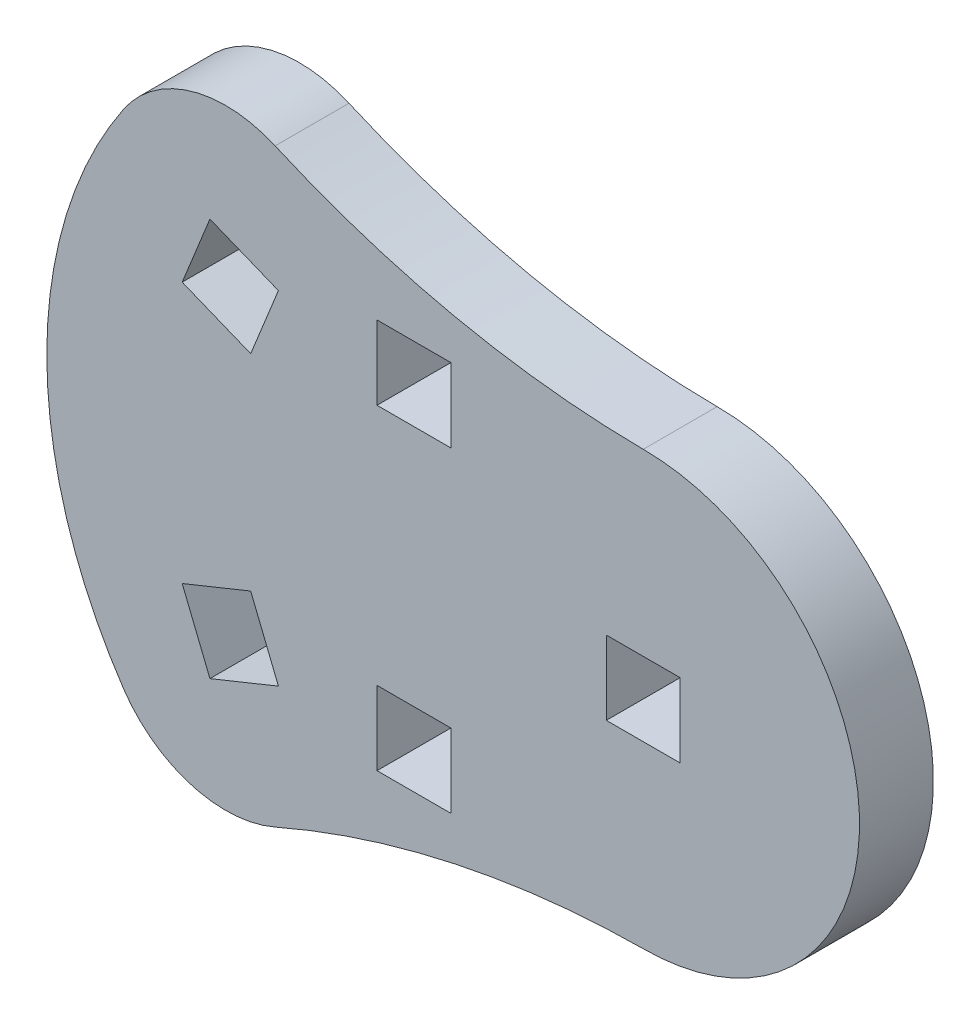
ISO-10303-21;
HEADER;
FILE_DESCRIPTION(('STEP AP214'),'2;1');
FILE_NAME('part.step','',(''),(''),'','','');
FILE_SCHEMA(('AUTOMOTIVE_DESIGN { 1 0 10303 214 1 1 1 1 }'));
ENDSEC;
DATA;
#1=APPLICATION_CONTEXT('core data for automotive mechanical design processes');
#2=APPLICATION_PROTOCOL_DEFINITION('international standard','automotive_design',2000,#1);
#3=PRODUCT_CONTEXT('',#1,'mechanical');
#4=PRODUCT('Part','Part','',(#3));
#5=PRODUCT_RELATED_PRODUCT_CATEGORY('part','',(#4));
#6=PRODUCT_DEFINITION_FORMATION('','',#4);
#7=PRODUCT_DEFINITION_CONTEXT('part definition',#1,'design');
#8=PRODUCT_DEFINITION('design','',#6,#7);
#9=PRODUCT_DEFINITION_SHAPE('','',#8);
#10=(LENGTH_UNIT() NAMED_UNIT(*) SI_UNIT(.MILLI.,.METRE.));
#11=(NAMED_UNIT(*) PLANE_ANGLE_UNIT() SI_UNIT($,.RADIAN.));
#12=(NAMED_UNIT(*) SI_UNIT($,.STERADIAN.) SOLID_ANGLE_UNIT());
#13=UNCERTAINTY_MEASURE_WITH_UNIT(LENGTH_MEASURE(1.E-05),#10,'distance_accuracy_value','');
#14=(GEOMETRIC_REPRESENTATION_CONTEXT(3) GLOBAL_UNCERTAINTY_ASSIGNED_CONTEXT((#13)) GLOBAL_UNIT_ASSIGNED_CONTEXT((#10,
#11,#12)) REPRESENTATION_CONTEXT('',''));
#15=CARTESIAN_POINT('',(0.,0.,0.));
#16=DIRECTION('',(0.,0.,1.));
#17=DIRECTION('',(1.,0.,0.));
#18=AXIS2_PLACEMENT_3D('',#15,#16,#17);
#19=CARTESIAN_POINT('',(4.1254731444134,-24.5350499056939,-1.524));
#20=DIRECTION('',(0.,0.,1.));
#21=DIRECTION('',(1.,0.,0.));
#22=AXIS2_PLACEMENT_3D('',#19,#20,#21);
#23=CYLINDRICAL_SURFACE('',#22,19.3127290930392);
#24=CARTESIAN_POINT('',(4.1254731444134,-24.5350499056939,0.));
#25=DIRECTION('',(0.,0.,-1.));
#26=DIRECTION('',(1.,0.,0.));
#27=AXIS2_PLACEMENT_3D('',#24,#25,#26);
#28=CIRCLE('',#27,19.3127290930392);
#29=CARTESIAN_POINT('',(-3.62584907118653,-6.84611243248575,0.));
#30=VERTEX_POINT('',#29);
#31=CARTESIAN_POINT('',(3.96754689049708,-5.22296652974908,0.));
#32=VERTEX_POINT('',#31);
#33=EDGE_CURVE('E363',#30,#32,#28,.T.);
#34=ORIENTED_EDGE('',*,*,#33,.F.);
#35=DIRECTION('',(0.,0.,1.));
#36=VECTOR('',#35,1.);
#37=CARTESIAN_POINT('',(-3.62584907118653,-6.84611243248575,-1.524));
#38=LINE('',#37,#36);
#39=CARTESIAN_POINT('',(-3.62584907118653,-6.84611243248575,-1.524));
#40=VERTEX_POINT('',#39);
#41=EDGE_CURVE('E11',#40,#30,#38,.T.);
#42=ORIENTED_EDGE('',*,*,#41,.F.);
#43=CARTESIAN_POINT('',(4.1254731444134,-24.5350499056939,-1.524));
#44=DIRECTION('',(0.,0.,-1.));
#45=DIRECTION('',(1.,0.,0.));
#46=AXIS2_PLACEMENT_3D('',#43,#44,#45);
#47=CIRCLE('',#46,19.3127290930392);
#48=CARTESIAN_POINT('',(3.96754689049708,-5.22296652974908,-1.524));
#49=VERTEX_POINT('',#48);
#50=EDGE_CURVE('E370',#40,#49,#47,.T.);
#51=ORIENTED_EDGE('',*,*,#50,.T.);
#52=DIRECTION('',(0.,0.,1.));
#53=VECTOR('',#52,1.);
#54=CARTESIAN_POINT('',(3.96754689049708,-5.22296652974908,-1.524));
#55=LINE('',#54,#53);
#56=EDGE_CURVE('E35',#49,#32,#55,.T.);
#57=ORIENTED_EDGE('',*,*,#56,.T.);
#58=EDGE_LOOP('',(#34,#42,#51,#57));
#59=FACE_BOUND('',#58,.T.);
#60=ADVANCED_FACE('F32',(#59),#23,.F.);
#61=CARTESIAN_POINT('',(-4.64529890309662,-4.51967265458078,-1.524));
#62=DIRECTION('',(0.,0.,1.));
#63=DIRECTION('',(1.,0.,0.));
#64=AXIS2_PLACEMENT_3D('',#61,#62,#63);
#65=CYLINDRICAL_SURFACE('',#64,2.54);
#66=CARTESIAN_POINT('',(-4.64529890309662,-4.51967265458078,0.));
#67=DIRECTION('',(0.,0.,1.));
#68=DIRECTION('',(-1.,0.,0.));
#69=AXIS2_PLACEMENT_3D('',#66,#67,#68);
#70=CIRCLE('',#69,2.54);
#71=CARTESIAN_POINT('',(-6.75027951638532,-5.94117067346041,0.));
#72=VERTEX_POINT('',#71);
#73=EDGE_CURVE('E374',#72,#30,#70,.T.);
#74=ORIENTED_EDGE('',*,*,#73,.F.);
#75=DIRECTION('',(0.,0.,1.));
#76=VECTOR('',#75,1.);
#77=CARTESIAN_POINT('',(-6.75027951638532,-5.94117067346041,-1.524));
#78=LINE('',#77,#76);
#79=CARTESIAN_POINT('',(-6.75027951638532,-5.94117067346041,-1.524));
#80=VERTEX_POINT('',#79);
#81=EDGE_CURVE('E40',#80,#72,#78,.T.);
#82=ORIENTED_EDGE('',*,*,#81,.F.);
#83=CARTESIAN_POINT('',(-4.64529890309662,-4.51967265458078,-1.524));
#84=DIRECTION('',(0.,0.,1.));
#85=DIRECTION('',(-1.,0.,0.));
#86=AXIS2_PLACEMENT_3D('',#83,#84,#85);
#87=CIRCLE('',#86,2.54);
#88=EDGE_CURVE('E386',#80,#40,#87,.T.);
#89=ORIENTED_EDGE('',*,*,#88,.T.);
#90=ORIENTED_EDGE('',*,*,#41,.T.);
#91=EDGE_LOOP('',(#74,#82,#89,#90));
#92=FACE_BOUND('',#91,.T.);
#93=ADVANCED_FACE('F423',(#92),#65,.T.);
#94=CARTESIAN_POINT('',(0.919132410857586,-0.762000000000003,-1.524));
#95=DIRECTION('',(0.,0.,1.));
#96=DIRECTION('',(1.,0.,0.));
#97=AXIS2_PLACEMENT_3D('',#94,#95,#96);
#98=CYLINDRICAL_SURFACE('',#97,9.2543875094232);
#99=CARTESIAN_POINT('',(0.919132410857586,-0.762000000000003,0.));
#100=DIRECTION('',(0.,0.,1.));
#101=DIRECTION('',(1.,0.,0.));
#102=AXIS2_PLACEMENT_3D('',#99,#100,#101);
#103=CIRCLE('',#102,9.2543875094232);
#104=CARTESIAN_POINT('',(-6.75027951638533,4.4171706734604,0.));
#105=VERTEX_POINT('',#104);
#106=EDGE_CURVE('E400',#105,#72,#103,.T.);
#107=ORIENTED_EDGE('',*,*,#106,.F.);
#108=DIRECTION('',(0.,0.,1.));
#109=VECTOR('',#108,1.);
#110=CARTESIAN_POINT('',(-6.75027951638533,4.4171706734604,-1.524));
#111=LINE('',#110,#109);
#112=CARTESIAN_POINT('',(-6.75027951638533,4.4171706734604,-1.524));
#113=VERTEX_POINT('',#112);
#114=EDGE_CURVE('E406',#113,#105,#111,.T.);
#115=ORIENTED_EDGE('',*,*,#114,.F.);
#116=CARTESIAN_POINT('',(0.919132410857586,-0.762000000000003,-1.524));
#117=DIRECTION('',(0.,0.,1.));
#118=DIRECTION('',(1.,0.,0.));
#119=AXIS2_PLACEMENT_3D('',#116,#117,#118);
#120=CIRCLE('',#119,9.2543875094232);
#121=EDGE_CURVE('E383',#113,#80,#120,.T.);
#122=ORIENTED_EDGE('',*,*,#121,.T.);
#123=ORIENTED_EDGE('',*,*,#81,.T.);
#124=EDGE_LOOP('',(#107,#115,#122,#123));
#125=FACE_BOUND('',#124,.T.);
#126=ADVANCED_FACE('F435',(#125),#98,.T.);
#127=CARTESIAN_POINT('',(-4.64529890309663,2.99567265458078,-1.524));
#128=DIRECTION('',(0.,0.,1.));
#129=DIRECTION('',(1.,0.,0.));
#130=AXIS2_PLACEMENT_3D('',#127,#128,#129);
#131=CYLINDRICAL_SURFACE('',#130,2.54);
#132=CARTESIAN_POINT('',(-4.64529890309663,2.99567265458078,0.));
#133=DIRECTION('',(0.,0.,1.));
#134=DIRECTION('',(1.,0.,0.));
#135=AXIS2_PLACEMENT_3D('',#132,#133,#134);
#136=CIRCLE('',#135,2.54);
#137=CARTESIAN_POINT('',(-3.62584907118654,5.32211243248575,0.));
#138=VERTEX_POINT('',#137);
#139=EDGE_CURVE('E397',#138,#105,#136,.T.);
#140=ORIENTED_EDGE('',*,*,#139,.F.);
#141=DIRECTION('',(0.,0.,1.));
#142=VECTOR('',#141,1.);
#143=CARTESIAN_POINT('',(-3.62584907118654,5.32211243248575,-1.524));
#144=LINE('',#143,#142);
#145=CARTESIAN_POINT('',(-3.62584907118654,5.32211243248575,-1.524));
#146=VERTEX_POINT('',#145);
#147=EDGE_CURVE('E408',#146,#138,#144,.T.);
#148=ORIENTED_EDGE('',*,*,#147,.F.);
#149=CARTESIAN_POINT('',(-4.64529890309663,2.99567265458078,-1.524));
#150=DIRECTION('',(0.,0.,1.));
#151=DIRECTION('',(1.,0.,0.));
#152=AXIS2_PLACEMENT_3D('',#149,#150,#151);
#153=CIRCLE('',#152,2.54);
#154=EDGE_CURVE('E380',#146,#113,#153,.T.);
#155=ORIENTED_EDGE('',*,*,#154,.T.);
#156=ORIENTED_EDGE('',*,*,#114,.T.);
#157=EDGE_LOOP('',(#140,#148,#155,#156));
#158=FACE_BOUND('',#157,.T.);
#159=ADVANCED_FACE('F433',(#158),#131,.T.);
#160=CARTESIAN_POINT('',(4.12547314441339,23.0110499056939,-1.524));
#161=DIRECTION('',(0.,0.,1.));
#162=DIRECTION('',(1.,0.,0.));
#163=AXIS2_PLACEMENT_3D('',#160,#161,#162);
#164=CYLINDRICAL_SURFACE('',#163,19.3127290930392);
#165=CARTESIAN_POINT('',(4.12547314441339,23.0110499056939,0.));
#166=DIRECTION('',(0.,0.,-1.));
#167=DIRECTION('',(-1.,0.,0.));
#168=AXIS2_PLACEMENT_3D('',#165,#166,#167);
#169=CIRCLE('',#168,19.3127290930392);
#170=CARTESIAN_POINT('',(3.96754689049709,3.69896652974907,0.));
#171=VERTEX_POINT('',#170);
#172=EDGE_CURVE('E394',#171,#138,#169,.T.);
#173=ORIENTED_EDGE('',*,*,#172,.F.);
#174=DIRECTION('',(0.,0.,1.));
#175=VECTOR('',#174,1.);
#176=CARTESIAN_POINT('',(3.96754689049709,3.69896652974907,-1.524));
#177=LINE('',#176,#175);
#178=CARTESIAN_POINT('',(3.96754689049709,3.69896652974907,-1.524));
#179=VERTEX_POINT('',#178);
#180=EDGE_CURVE('E409',#179,#171,#177,.T.);
#181=ORIENTED_EDGE('',*,*,#180,.F.);
#182=CARTESIAN_POINT('',(4.12547314441339,23.0110499056939,-1.524));
#183=DIRECTION('',(0.,0.,-1.));
#184=DIRECTION('',(-1.,0.,0.));
#185=AXIS2_PLACEMENT_3D('',#182,#183,#184);
#186=CIRCLE('',#185,19.3127290930392);
#187=EDGE_CURVE('E377',#179,#146,#186,.T.);
#188=ORIENTED_EDGE('',*,*,#187,.T.);
#189=ORIENTED_EDGE('',*,*,#147,.T.);
#190=EDGE_LOOP('',(#173,#181,#188,#189));
#191=FACE_BOUND('',#190,.T.);
#192=ADVANCED_FACE('F430',(#191),#164,.F.);
#193=CARTESIAN_POINT('',(3.96754689049708,-0.762000000000004,-1.524));
#194=DIRECTION('',(0.,0.,1.));
#195=DIRECTION('',(1.,0.,0.));
#196=AXIS2_PLACEMENT_3D('',#193,#194,#195);
#197=CYLINDRICAL_SURFACE('',#196,4.46096652974907);
#198=CARTESIAN_POINT('',(3.96754689049708,-0.762000000000004,0.));
#199=DIRECTION('',(0.,0.,1.));
#200=DIRECTION('',(1.,0.,0.));
#201=AXIS2_PLACEMENT_3D('',#198,#199,#200);
#202=CIRCLE('',#201,4.46096652974907);
#203=EDGE_CURVE('E391',#32,#171,#202,.T.);
#204=ORIENTED_EDGE('',*,*,#203,.F.);
#205=ORIENTED_EDGE('',*,*,#56,.F.);
#206=CARTESIAN_POINT('',(3.96754689049708,-0.762000000000004,-1.524));
#207=DIRECTION('',(0.,0.,1.));
#208=DIRECTION('',(1.,0.,0.));
#209=AXIS2_PLACEMENT_3D('',#206,#207,#208);
#210=CIRCLE('',#209,4.46096652974907);
#211=EDGE_CURVE('E373',#49,#179,#210,.T.);
#212=ORIENTED_EDGE('',*,*,#211,.T.);
#213=ORIENTED_EDGE('',*,*,#180,.T.);
#214=EDGE_LOOP('',(#204,#205,#212,#213));
#215=FACE_BOUND('',#214,.T.);
#216=ADVANCED_FACE('F417',(#215),#197,.T.);
#217=CARTESIAN_POINT('',(-0.259912879341608,-14.5273612801374,-1.524));
#218=DIRECTION('',(0.,0.,1.));
#219=DIRECTION('',(1.,0.,0.));
#220=AXIS2_PLACEMENT_3D('',#217,#218,#219);
#221=PLANE('',#220);
#222=DIRECTION('',(0.92694211859399,0.375204356020138,0.));
#223=VECTOR('',#222,1.);
#224=CARTESIAN_POINT('',(-3.55801460567148,-4.29470158343371,-1.524));
#225=LINE('',#224,#223);
#226=CARTESIAN_POINT('',(-4.97067439440872,-4.8665130220084,-1.524));
#227=VERTEX_POINT('',#226);
#228=CARTESIAN_POINT('',(-3.55801460567148,-4.29470158343371,-1.524));
#229=VERTEX_POINT('',#228);
#230=EDGE_CURVE('E213',#227,#229,#225,.T.);
#231=ORIENTED_EDGE('',*,*,#230,.T.);
#232=DIRECTION('',(-0.375204356020138,0.92694211859399,0.));
#233=VECTOR('',#232,1.);
#234=CARTESIAN_POINT('',(-4.12982604424617,-2.88204179469647,-1.524));
#235=LINE('',#234,#233);
#236=CARTESIAN_POINT('',(-4.12982604424617,-2.88204179469647,-1.524));
#237=VERTEX_POINT('',#236);
#238=EDGE_CURVE('E207',#229,#237,#235,.T.);
#239=ORIENTED_EDGE('',*,*,#238,.T.);
#240=DIRECTION('',(-0.926942118593989,-0.375204356020138,0.));
#241=VECTOR('',#240,1.);
#242=CARTESIAN_POINT('',(-4.12982604424617,-2.88204179469647,-1.524));
#243=LINE('',#242,#241);
#244=CARTESIAN_POINT('',(-5.54248583298341,-3.45385323327116,-1.524));
#245=VERTEX_POINT('',#244);
#246=EDGE_CURVE('E216',#237,#245,#243,.T.);
#247=ORIENTED_EDGE('',*,*,#246,.T.);
#248=DIRECTION('',(0.375204356020137,-0.92694211859399,0.));
#249=VECTOR('',#248,1.);
#250=CARTESIAN_POINT('',(-5.54248583298341,-3.45385323327116,-1.524));
#251=LINE('',#250,#249);
#252=EDGE_CURVE('E48',#245,#227,#251,.T.);
#253=ORIENTED_EDGE('',*,*,#252,.T.);
#254=EDGE_LOOP('',(#231,#239,#247,#253));
#255=FACE_BOUND('',#254,.T.);
#256=DIRECTION('',(-0.375204356020136,-0.92694211859399,0.));
#257=VECTOR('',#256,1.);
#258=CARTESIAN_POINT('',(-5.54248583298341,1.92985323327115,-1.524));
#259=LINE('',#258,#257);
#260=CARTESIAN_POINT('',(-4.97067439440872,3.34251302200839,-1.524));
#261=VERTEX_POINT('',#260);
#262=CARTESIAN_POINT('',(-5.54248583298341,1.92985323327115,-1.524));
#263=VERTEX_POINT('',#262);
#264=EDGE_CURVE('E252',#261,#263,#259,.T.);
#265=ORIENTED_EDGE('',*,*,#264,.T.);
#266=DIRECTION('',(0.92694211859399,-0.375204356020137,0.));
#267=VECTOR('',#266,1.);
#268=CARTESIAN_POINT('',(-4.12982604424617,1.35804179469646,-1.524));
#269=LINE('',#268,#267);
#270=CARTESIAN_POINT('',(-4.12982604424617,1.35804179469646,-1.524));
#271=VERTEX_POINT('',#270);
#272=EDGE_CURVE('E242',#263,#271,#269,.T.);
#273=ORIENTED_EDGE('',*,*,#272,.T.);
#274=DIRECTION('',(0.375204356020138,0.92694211859399,0.));
#275=VECTOR('',#274,1.);
#276=CARTESIAN_POINT('',(-4.12982604424617,1.35804179469646,-1.524));
#277=LINE('',#276,#275);
#278=CARTESIAN_POINT('',(-3.55801460567148,2.7707015834337,-1.524));
#279=VERTEX_POINT('',#278);
#280=EDGE_CURVE('E245',#271,#279,#277,.T.);
#281=ORIENTED_EDGE('',*,*,#280,.T.);
#282=DIRECTION('',(-0.926942118593989,0.375204356020138,0.));
#283=VECTOR('',#282,1.);
#284=CARTESIAN_POINT('',(-3.55801460567148,2.7707015834337,-1.524));
#285=LINE('',#284,#283);
#286=EDGE_CURVE('E249',#279,#261,#285,.T.);
#287=ORIENTED_EDGE('',*,*,#286,.T.);
#288=EDGE_LOOP('',(#265,#273,#281,#287));
#289=FACE_BOUND('',#288,.T.);
#290=DIRECTION('',(1.,0.,0.));
#291=VECTOR('',#290,1.);
#292=CARTESIAN_POINT('',(3.20554689049708,-1.524,-1.524));
#293=LINE('',#292,#291);
#294=CARTESIAN_POINT('',(3.20554689049708,-1.524,-1.524));
#295=VERTEX_POINT('',#294);
#296=CARTESIAN_POINT('',(4.72954689049708,-1.524,-1.524));
#297=VERTEX_POINT('',#296);
#298=EDGE_CURVE('E284',#295,#297,#293,.T.);
#299=ORIENTED_EDGE('',*,*,#298,.T.);
#300=DIRECTION('',(0.,1.,0.));
#301=VECTOR('',#300,1.);
#302=CARTESIAN_POINT('',(4.72954689049708,-1.524,-1.524));
#303=LINE('',#302,#301);
#304=CARTESIAN_POINT('',(4.72954689049708,0.,-1.524));
#305=VERTEX_POINT('',#304);
#306=EDGE_CURVE('E274',#297,#305,#303,.T.);
#307=ORIENTED_EDGE('',*,*,#306,.T.);
#308=DIRECTION('',(-1.,0.,0.));
#309=VECTOR('',#308,1.);
#310=CARTESIAN_POINT('',(3.20554689049708,0.,-1.524));
#311=LINE('',#310,#309);
#312=CARTESIAN_POINT('',(3.20554689049708,0.,-1.524));
#313=VERTEX_POINT('',#312);
#314=EDGE_CURVE('E277',#305,#313,#311,.T.);
#315=ORIENTED_EDGE('',*,*,#314,.T.);
#316=DIRECTION('',(0.,-1.,0.));
#317=VECTOR('',#316,1.);
#318=CARTESIAN_POINT('',(3.20554689049708,-1.524,-1.524));
#319=LINE('',#318,#317);
#320=EDGE_CURVE('E281',#313,#295,#319,.T.);
#321=ORIENTED_EDGE('',*,*,#320,.T.);
#322=EDGE_LOOP('',(#299,#307,#315,#321));
#323=FACE_BOUND('',#322,.T.);
#324=DIRECTION('',(1.,0.,0.));
#325=VECTOR('',#324,1.);
#326=CARTESIAN_POINT('',(0.,1.73975063812974,-1.524));
#327=LINE('',#326,#325);
#328=CARTESIAN_POINT('',(-1.52400000000001,1.73975063812974,-1.524));
#329=VERTEX_POINT('',#328);
#330=CARTESIAN_POINT('',(0.,1.73975063812974,-1.524));
#331=VERTEX_POINT('',#330);
#332=EDGE_CURVE('E316',#329,#331,#327,.T.);
#333=ORIENTED_EDGE('',*,*,#332,.T.);
#334=DIRECTION('',(0.,1.,0.));
#335=VECTOR('',#334,1.);
#336=CARTESIAN_POINT('',(0.,1.73975063812974,-1.524));
#337=LINE('',#336,#335);
#338=CARTESIAN_POINT('',(0.,3.26375063812974,-1.524));
#339=VERTEX_POINT('',#338);
#340=EDGE_CURVE('E306',#331,#339,#337,.T.);
#341=ORIENTED_EDGE('',*,*,#340,.T.);
#342=DIRECTION('',(-1.,0.,0.));
#343=VECTOR('',#342,1.);
#344=CARTESIAN_POINT('',(0.,3.26375063812974,-1.524));
#345=LINE('',#344,#343);
#346=CARTESIAN_POINT('',(-1.52400000000001,3.26375063812974,-1.524));
#347=VERTEX_POINT('',#346);
#348=EDGE_CURVE('E309',#339,#347,#345,.T.);
#349=ORIENTED_EDGE('',*,*,#348,.T.);
#350=DIRECTION('',(0.,-1.,0.));
#351=VECTOR('',#350,1.);
#352=CARTESIAN_POINT('',(-1.52400000000001,1.73975063812974,-1.524));
#353=LINE('',#352,#351);
#354=EDGE_CURVE('E313',#347,#329,#353,.T.);
#355=ORIENTED_EDGE('',*,*,#354,.T.);
#356=EDGE_LOOP('',(#333,#341,#349,#355));
#357=FACE_BOUND('',#356,.T.);
#358=DIRECTION('',(-1.,0.,0.));
#359=VECTOR('',#358,1.);
#360=CARTESIAN_POINT('',(-1.52400000000001,-3.26375063812976,-1.524));
#361=LINE('',#360,#359);
#362=CARTESIAN_POINT('',(0.,-3.26375063812976,-1.524));
#363=VERTEX_POINT('',#362);
#364=CARTESIAN_POINT('',(-1.52400000000001,-3.26375063812976,-1.524));
#365=VERTEX_POINT('',#364);
#366=EDGE_CURVE('E348',#363,#365,#361,.T.);
#367=ORIENTED_EDGE('',*,*,#366,.T.);
#368=DIRECTION('',(0.,-1.,0.));
#369=VECTOR('',#368,1.);
#370=CARTESIAN_POINT('',(-1.52400000000001,-4.78775063812976,-1.524));
#371=LINE('',#370,#369);
#372=CARTESIAN_POINT('',(-1.52400000000001,-4.78775063812976,-1.524));
#373=VERTEX_POINT('',#372);
#374=EDGE_CURVE('E338',#365,#373,#371,.T.);
#375=ORIENTED_EDGE('',*,*,#374,.T.);
#376=DIRECTION('',(1.,0.,0.));
#377=VECTOR('',#376,1.);
#378=CARTESIAN_POINT('',(-1.52400000000001,-4.78775063812976,-1.524));
#379=LINE('',#378,#377);
#380=CARTESIAN_POINT('',(0.,-4.78775063812976,-1.524));
#381=VERTEX_POINT('',#380);
#382=EDGE_CURVE('E341',#373,#381,#379,.T.);
#383=ORIENTED_EDGE('',*,*,#382,.T.);
#384=DIRECTION('',(0.,1.,0.));
#385=VECTOR('',#384,1.);
#386=CARTESIAN_POINT('',(0.,-4.78775063812976,-1.524));
#387=LINE('',#386,#385);
#388=EDGE_CURVE('E345',#381,#363,#387,.T.);
#389=ORIENTED_EDGE('',*,*,#388,.T.);
#390=EDGE_LOOP('',(#367,#375,#383,#389));
#391=FACE_BOUND('',#390,.T.);
#392=ORIENTED_EDGE('',*,*,#50,.F.);
#393=ORIENTED_EDGE('',*,*,#88,.F.);
#394=ORIENTED_EDGE('',*,*,#121,.F.);
#395=ORIENTED_EDGE('',*,*,#154,.F.);
#396=ORIENTED_EDGE('',*,*,#187,.F.);
#397=ORIENTED_EDGE('',*,*,#211,.F.);
#398=EDGE_LOOP('',(#392,#393,#394,#395,#396,#397));
#399=FACE_BOUND('',#398,.T.);
#400=ADVANCED_FACE('F220',(#255,#289,#323,#357,#391,#399),#221,.F.);
#401=CARTESIAN_POINT('',(-0.259912879341608,-14.5273612801374,0.));
#402=DIRECTION('',(0.,0.,1.));
#403=DIRECTION('',(1.,0.,0.));
#404=AXIS2_PLACEMENT_3D('',#401,#402,#403);
#405=PLANE('',#404);
#406=DIRECTION('',(-0.375204356020138,0.92694211859399,0.));
#407=VECTOR('',#406,1.);
#408=CARTESIAN_POINT('',(-4.12982604424617,-2.88204179469647,0.));
#409=LINE('',#408,#407);
#410=CARTESIAN_POINT('',(-3.55801460567148,-4.29470158343371,0.));
#411=VERTEX_POINT('',#410);
#412=CARTESIAN_POINT('',(-4.12982604424617,-2.88204179469647,0.));
#413=VERTEX_POINT('',#412);
#414=EDGE_CURVE('E56',#411,#413,#409,.T.);
#415=ORIENTED_EDGE('',*,*,#414,.F.);
#416=DIRECTION('',(0.92694211859399,0.375204356020138,0.));
#417=VECTOR('',#416,1.);
#418=CARTESIAN_POINT('',(-3.55801460567148,-4.29470158343371,0.));
#419=LINE('',#418,#417);
#420=CARTESIAN_POINT('',(-4.97067439440872,-4.8665130220084,0.));
#421=VERTEX_POINT('',#420);
#422=EDGE_CURVE('E223',#421,#411,#419,.T.);
#423=ORIENTED_EDGE('',*,*,#422,.F.);
#424=DIRECTION('',(0.375204356020137,-0.92694211859399,0.));
#425=VECTOR('',#424,1.);
#426=CARTESIAN_POINT('',(-5.54248583298341,-3.45385323327116,0.));
#427=LINE('',#426,#425);
#428=CARTESIAN_POINT('',(-5.54248583298341,-3.45385323327116,0.));
#429=VERTEX_POINT('',#428);
#430=EDGE_CURVE('E226',#429,#421,#427,.T.);
#431=ORIENTED_EDGE('',*,*,#430,.F.);
#432=DIRECTION('',(-0.926942118593989,-0.375204356020138,0.));
#433=VECTOR('',#432,1.);
#434=CARTESIAN_POINT('',(-4.12982604424617,-2.88204179469647,0.));
#435=LINE('',#434,#433);
#436=EDGE_CURVE('E232',#413,#429,#435,.T.);
#437=ORIENTED_EDGE('',*,*,#436,.F.);
#438=EDGE_LOOP('',(#415,#423,#431,#437));
#439=FACE_BOUND('',#438,.T.);
#440=DIRECTION('',(0.92694211859399,-0.375204356020137,0.));
#441=VECTOR('',#440,1.);
#442=CARTESIAN_POINT('',(-4.12982604424617,1.35804179469646,0.));
#443=LINE('',#442,#441);
#444=CARTESIAN_POINT('',(-5.54248583298341,1.92985323327115,0.));
#445=VERTEX_POINT('',#444);
#446=CARTESIAN_POINT('',(-4.12982604424617,1.35804179469646,0.));
#447=VERTEX_POINT('',#446);
#448=EDGE_CURVE('E238',#445,#447,#443,.T.);
#449=ORIENTED_EDGE('',*,*,#448,.F.);
#450=DIRECTION('',(-0.375204356020136,-0.92694211859399,0.));
#451=VECTOR('',#450,1.);
#452=CARTESIAN_POINT('',(-5.54248583298341,1.92985323327115,0.));
#453=LINE('',#452,#451);
#454=CARTESIAN_POINT('',(-4.97067439440872,3.34251302200839,0.));
#455=VERTEX_POINT('',#454);
#456=EDGE_CURVE('E246',#455,#445,#453,.T.);
#457=ORIENTED_EDGE('',*,*,#456,.F.);
#458=DIRECTION('',(-0.926942118593989,0.375204356020138,0.));
#459=VECTOR('',#458,1.);
#460=CARTESIAN_POINT('',(-3.55801460567148,2.7707015834337,0.));
#461=LINE('',#460,#459);
#462=CARTESIAN_POINT('',(-3.55801460567148,2.7707015834337,0.));
#463=VERTEX_POINT('',#462);
#464=EDGE_CURVE('E260',#463,#455,#461,.T.);
#465=ORIENTED_EDGE('',*,*,#464,.F.);
#466=DIRECTION('',(0.375204356020138,0.92694211859399,0.));
#467=VECTOR('',#466,1.);
#468=CARTESIAN_POINT('',(-4.12982604424617,1.35804179469646,0.));
#469=LINE('',#468,#467);
#470=EDGE_CURVE('E257',#447,#463,#469,.T.);
#471=ORIENTED_EDGE('',*,*,#470,.F.);
#472=EDGE_LOOP('',(#449,#457,#465,#471));
#473=FACE_BOUND('',#472,.T.);
#474=DIRECTION('',(0.,1.,0.));
#475=VECTOR('',#474,1.);
#476=CARTESIAN_POINT('',(4.72954689049708,-1.524,0.));
#477=LINE('',#476,#475);
#478=CARTESIAN_POINT('',(4.72954689049708,-1.524,0.));
#479=VERTEX_POINT('',#478);
#480=CARTESIAN_POINT('',(4.72954689049708,0.,0.));
#481=VERTEX_POINT('',#480);
#482=EDGE_CURVE('E267',#479,#481,#477,.T.);
#483=ORIENTED_EDGE('',*,*,#482,.F.);
#484=DIRECTION('',(1.,0.,0.));
#485=VECTOR('',#484,1.);
#486=CARTESIAN_POINT('',(3.20554689049708,-1.524,0.));
#487=LINE('',#486,#485);
#488=CARTESIAN_POINT('',(3.20554689049708,-1.524,0.));
#489=VERTEX_POINT('',#488);
#490=EDGE_CURVE('E278',#489,#479,#487,.T.);
#491=ORIENTED_EDGE('',*,*,#490,.F.);
#492=DIRECTION('',(0.,-1.,0.));
#493=VECTOR('',#492,1.);
#494=CARTESIAN_POINT('',(3.20554689049708,-1.524,0.));
#495=LINE('',#494,#493);
#496=CARTESIAN_POINT('',(3.20554689049708,0.,0.));
#497=VERTEX_POINT('',#496);
#498=EDGE_CURVE('E292',#497,#489,#495,.T.);
#499=ORIENTED_EDGE('',*,*,#498,.F.);
#500=DIRECTION('',(-1.,0.,0.));
#501=VECTOR('',#500,1.);
#502=CARTESIAN_POINT('',(3.20554689049708,0.,0.));
#503=LINE('',#502,#501);
#504=EDGE_CURVE('E289',#481,#497,#503,.T.);
#505=ORIENTED_EDGE('',*,*,#504,.F.);
#506=EDGE_LOOP('',(#483,#491,#499,#505));
#507=FACE_BOUND('',#506,.T.);
#508=DIRECTION('',(0.,1.,0.));
#509=VECTOR('',#508,1.);
#510=CARTESIAN_POINT('',(0.,1.73975063812974,0.));
#511=LINE('',#510,#509);
#512=CARTESIAN_POINT('',(0.,1.73975063812974,0.));
#513=VERTEX_POINT('',#512);
#514=CARTESIAN_POINT('',(0.,3.26375063812974,0.));
#515=VERTEX_POINT('',#514);
#516=EDGE_CURVE('E299',#513,#515,#511,.T.);
#517=ORIENTED_EDGE('',*,*,#516,.F.);
#518=DIRECTION('',(1.,0.,0.));
#519=VECTOR('',#518,1.);
#520=CARTESIAN_POINT('',(0.,1.73975063812974,0.));
#521=LINE('',#520,#519);
#522=CARTESIAN_POINT('',(-1.52400000000001,1.73975063812974,0.));
#523=VERTEX_POINT('',#522);
#524=EDGE_CURVE('E310',#523,#513,#521,.T.);
#525=ORIENTED_EDGE('',*,*,#524,.F.);
#526=DIRECTION('',(0.,-1.,0.));
#527=VECTOR('',#526,1.);
#528=CARTESIAN_POINT('',(-1.52400000000001,1.73975063812974,0.));
#529=LINE('',#528,#527);
#530=CARTESIAN_POINT('',(-1.52400000000001,3.26375063812974,0.));
#531=VERTEX_POINT('',#530);
#532=EDGE_CURVE('E324',#531,#523,#529,.T.);
#533=ORIENTED_EDGE('',*,*,#532,.F.);
#534=DIRECTION('',(-1.,0.,0.));
#535=VECTOR('',#534,1.);
#536=CARTESIAN_POINT('',(0.,3.26375063812974,0.));
#537=LINE('',#536,#535);
#538=EDGE_CURVE('E321',#515,#531,#537,.T.);
#539=ORIENTED_EDGE('',*,*,#538,.F.);
#540=EDGE_LOOP('',(#517,#525,#533,#539));
#541=FACE_BOUND('',#540,.T.);
#542=DIRECTION('',(0.,-1.,0.));
#543=VECTOR('',#542,1.);
#544=CARTESIAN_POINT('',(-1.52400000000001,-4.78775063812976,0.));
#545=LINE('',#544,#543);
#546=CARTESIAN_POINT('',(-1.52400000000001,-3.26375063812976,0.));
#547=VERTEX_POINT('',#546);
#548=CARTESIAN_POINT('',(-1.52400000000001,-4.78775063812976,0.));
#549=VERTEX_POINT('',#548);
#550=EDGE_CURVE('E331',#547,#549,#545,.T.);
#551=ORIENTED_EDGE('',*,*,#550,.F.);
#552=DIRECTION('',(-1.,0.,0.));
#553=VECTOR('',#552,1.);
#554=CARTESIAN_POINT('',(-1.52400000000001,-3.26375063812976,0.));
#555=LINE('',#554,#553);
#556=CARTESIAN_POINT('',(0.,-3.26375063812976,0.));
#557=VERTEX_POINT('',#556);
#558=EDGE_CURVE('E342',#557,#547,#555,.T.);
#559=ORIENTED_EDGE('',*,*,#558,.F.);
#560=DIRECTION('',(0.,1.,0.));
#561=VECTOR('',#560,1.);
#562=CARTESIAN_POINT('',(0.,-4.78775063812976,0.));
#563=LINE('',#562,#561);
#564=CARTESIAN_POINT('',(0.,-4.78775063812976,0.));
#565=VERTEX_POINT('',#564);
#566=EDGE_CURVE('E356',#565,#557,#563,.T.);
#567=ORIENTED_EDGE('',*,*,#566,.F.);
#568=DIRECTION('',(1.,0.,0.));
#569=VECTOR('',#568,1.);
#570=CARTESIAN_POINT('',(-1.52400000000001,-4.78775063812976,0.));
#571=LINE('',#570,#569);
#572=EDGE_CURVE('E353',#549,#565,#571,.T.);
#573=ORIENTED_EDGE('',*,*,#572,.F.);
#574=EDGE_LOOP('',(#551,#559,#567,#573));
#575=FACE_BOUND('',#574,.T.);
#576=ORIENTED_EDGE('',*,*,#33,.T.);
#577=ORIENTED_EDGE('',*,*,#203,.T.);
#578=ORIENTED_EDGE('',*,*,#172,.T.);
#579=ORIENTED_EDGE('',*,*,#139,.T.);
#580=ORIENTED_EDGE('',*,*,#106,.T.);
#581=ORIENTED_EDGE('',*,*,#73,.T.);
#582=EDGE_LOOP('',(#576,#577,#578,#579,#580,#581));
#583=FACE_BOUND('',#582,.T.);
#584=ADVANCED_FACE('F419',(#439,#473,#507,#541,#575,#583),#405,.T.);
#585=CARTESIAN_POINT('',(-1.52400000000001,-4.78775063812976,-1.524));
#586=DIRECTION('',(-1.,0.,0.));
#587=DIRECTION('',(0.,0.,1.));
#588=AXIS2_PLACEMENT_3D('',#585,#586,#587);
#589=PLANE('',#588);
#590=ORIENTED_EDGE('',*,*,#550,.T.);
#591=DIRECTION('',(0.,0.,1.));
#592=VECTOR('',#591,1.);
#593=CARTESIAN_POINT('',(-1.52400000000001,-4.78775063812976,-1.524));
#594=LINE('',#593,#592);
#595=EDGE_CURVE('E351',#373,#549,#594,.T.);
#596=ORIENTED_EDGE('',*,*,#595,.F.);
#597=ORIENTED_EDGE('',*,*,#374,.F.);
#598=DIRECTION('',(0.,0.,1.));
#599=VECTOR('',#598,1.);
#600=CARTESIAN_POINT('',(-1.52400000000001,-3.26375063812976,-1.524));
#601=LINE('',#600,#599);
#602=EDGE_CURVE('E361',#365,#547,#601,.T.);
#603=ORIENTED_EDGE('',*,*,#602,.T.);
#604=EDGE_LOOP('',(#590,#596,#597,#603));
#605=FACE_BOUND('',#604,.T.);
#606=ADVANCED_FACE('F493',(#605),#589,.F.);
#607=CARTESIAN_POINT('',(-1.52400000000001,-3.26375063812976,-1.524));
#608=DIRECTION('',(0.,1.,0.));
#609=DIRECTION('',(0.,0.,1.));
#610=AXIS2_PLACEMENT_3D('',#607,#608,#609);
#611=PLANE('',#610);
#612=ORIENTED_EDGE('',*,*,#558,.T.);
#613=ORIENTED_EDGE('',*,*,#602,.F.);
#614=ORIENTED_EDGE('',*,*,#366,.F.);
#615=DIRECTION('',(0.,0.,1.));
#616=VECTOR('',#615,1.);
#617=CARTESIAN_POINT('',(0.,-3.26375063812976,-1.524));
#618=LINE('',#617,#616);
#619=EDGE_CURVE('E364',#363,#557,#618,.T.);
#620=ORIENTED_EDGE('',*,*,#619,.T.);
#621=EDGE_LOOP('',(#612,#613,#614,#620));
#622=FACE_BOUND('',#621,.T.);
#623=ADVANCED_FACE('F503',(#622),#611,.F.);
#624=CARTESIAN_POINT('',(0.,-4.78775063812976,-1.524));
#625=DIRECTION('',(1.,0.,0.));
#626=DIRECTION('',(0.,0.,-1.));
#627=AXIS2_PLACEMENT_3D('',#624,#625,#626);
#628=PLANE('',#627);
#629=ORIENTED_EDGE('',*,*,#566,.T.);
#630=ORIENTED_EDGE('',*,*,#619,.F.);
#631=ORIENTED_EDGE('',*,*,#388,.F.);
#632=DIRECTION('',(0.,0.,1.));
#633=VECTOR('',#632,1.);
#634=CARTESIAN_POINT('',(0.,-4.78775063812976,-1.524));
#635=LINE('',#634,#633);
#636=EDGE_CURVE('E366',#381,#565,#635,.T.);
#637=ORIENTED_EDGE('',*,*,#636,.T.);
#638=EDGE_LOOP('',(#629,#630,#631,#637));
#639=FACE_BOUND('',#638,.T.);
#640=ADVANCED_FACE('F513',(#639),#628,.F.);
#641=CARTESIAN_POINT('',(-1.52400000000001,-4.78775063812976,-1.524));
#642=DIRECTION('',(0.,-1.,0.));
#643=DIRECTION('',(0.,0.,-1.));
#644=AXIS2_PLACEMENT_3D('',#641,#642,#643);
#645=PLANE('',#644);
#646=ORIENTED_EDGE('',*,*,#572,.T.);
#647=ORIENTED_EDGE('',*,*,#636,.F.);
#648=ORIENTED_EDGE('',*,*,#382,.F.);
#649=ORIENTED_EDGE('',*,*,#595,.T.);
#650=EDGE_LOOP('',(#646,#647,#648,#649));
#651=FACE_BOUND('',#650,.T.);
#652=ADVANCED_FACE('F523',(#651),#645,.F.);
#653=CARTESIAN_POINT('',(0.,1.73975063812974,-1.524));
#654=DIRECTION('',(1.,0.,0.));
#655=DIRECTION('',(0.,0.,-1.));
#656=AXIS2_PLACEMENT_3D('',#653,#654,#655);
#657=PLANE('',#656);
#658=ORIENTED_EDGE('',*,*,#516,.T.);
#659=DIRECTION('',(0.,0.,1.));
#660=VECTOR('',#659,1.);
#661=CARTESIAN_POINT('',(0.,3.26375063812974,-1.524));
#662=LINE('',#661,#660);
#663=EDGE_CURVE('E319',#339,#515,#662,.T.);
#664=ORIENTED_EDGE('',*,*,#663,.F.);
#665=ORIENTED_EDGE('',*,*,#340,.F.);
#666=DIRECTION('',(0.,0.,1.));
#667=VECTOR('',#666,1.);
#668=CARTESIAN_POINT('',(0.,1.73975063812974,-1.524));
#669=LINE('',#668,#667);
#670=EDGE_CURVE('E329',#331,#513,#669,.T.);
#671=ORIENTED_EDGE('',*,*,#670,.T.);
#672=EDGE_LOOP('',(#658,#664,#665,#671));
#673=FACE_BOUND('',#672,.T.);
#674=ADVANCED_FACE('F533',(#673),#657,.F.);
#675=CARTESIAN_POINT('',(0.,1.73975063812974,-1.524));
#676=DIRECTION('',(0.,-1.,0.));
#677=DIRECTION('',(0.,0.,-1.));
#678=AXIS2_PLACEMENT_3D('',#675,#676,#677);
#679=PLANE('',#678);
#680=ORIENTED_EDGE('',*,*,#524,.T.);
#681=ORIENTED_EDGE('',*,*,#670,.F.);
#682=ORIENTED_EDGE('',*,*,#332,.F.);
#683=DIRECTION('',(0.,0.,1.));
#684=VECTOR('',#683,1.);
#685=CARTESIAN_POINT('',(-1.52400000000001,1.73975063812974,-1.524));
#686=LINE('',#685,#684);
#687=EDGE_CURVE('E332',#329,#523,#686,.T.);
#688=ORIENTED_EDGE('',*,*,#687,.T.);
#689=EDGE_LOOP('',(#680,#681,#682,#688));
#690=FACE_BOUND('',#689,.T.);
#691=ADVANCED_FACE('F543',(#690),#679,.F.);
#692=CARTESIAN_POINT('',(-1.52400000000001,1.73975063812974,-1.524));
#693=DIRECTION('',(-1.,0.,0.));
#694=DIRECTION('',(0.,0.,1.));
#695=AXIS2_PLACEMENT_3D('',#692,#693,#694);
#696=PLANE('',#695);
#697=ORIENTED_EDGE('',*,*,#532,.T.);
#698=ORIENTED_EDGE('',*,*,#687,.F.);
#699=ORIENTED_EDGE('',*,*,#354,.F.);
#700=DIRECTION('',(0.,0.,1.));
#701=VECTOR('',#700,1.);
#702=CARTESIAN_POINT('',(-1.52400000000001,3.26375063812974,-1.524));
#703=LINE('',#702,#701);
#704=EDGE_CURVE('E334',#347,#531,#703,.T.);
#705=ORIENTED_EDGE('',*,*,#704,.T.);
#706=EDGE_LOOP('',(#697,#698,#699,#705));
#707=FACE_BOUND('',#706,.T.);
#708=ADVANCED_FACE('F553',(#707),#696,.F.);
#709=CARTESIAN_POINT('',(0.,3.26375063812974,-1.524));
#710=DIRECTION('',(0.,1.,0.));
#711=DIRECTION('',(0.,0.,1.));
#712=AXIS2_PLACEMENT_3D('',#709,#710,#711);
#713=PLANE('',#712);
#714=ORIENTED_EDGE('',*,*,#538,.T.);
#715=ORIENTED_EDGE('',*,*,#704,.F.);
#716=ORIENTED_EDGE('',*,*,#348,.F.);
#717=ORIENTED_EDGE('',*,*,#663,.T.);
#718=EDGE_LOOP('',(#714,#715,#716,#717));
#719=FACE_BOUND('',#718,.T.);
#720=ADVANCED_FACE('F563',(#719),#713,.F.);
#721=CARTESIAN_POINT('',(4.72954689049708,-1.524,-1.524));
#722=DIRECTION('',(1.,0.,0.));
#723=DIRECTION('',(0.,0.,-1.));
#724=AXIS2_PLACEMENT_3D('',#721,#722,#723);
#725=PLANE('',#724);
#726=ORIENTED_EDGE('',*,*,#482,.T.);
#727=DIRECTION('',(0.,0.,1.));
#728=VECTOR('',#727,1.);
#729=CARTESIAN_POINT('',(4.72954689049708,0.,-1.524));
#730=LINE('',#729,#728);
#731=EDGE_CURVE('E287',#305,#481,#730,.T.);
#732=ORIENTED_EDGE('',*,*,#731,.F.);
#733=ORIENTED_EDGE('',*,*,#306,.F.);
#734=DIRECTION('',(0.,0.,1.));
#735=VECTOR('',#734,1.);
#736=CARTESIAN_POINT('',(4.72954689049708,-1.524,-1.524));
#737=LINE('',#736,#735);
#738=EDGE_CURVE('E297',#297,#479,#737,.T.);
#739=ORIENTED_EDGE('',*,*,#738,.T.);
#740=EDGE_LOOP('',(#726,#732,#733,#739));
#741=FACE_BOUND('',#740,.T.);
#742=ADVANCED_FACE('F573',(#741),#725,.F.);
#743=CARTESIAN_POINT('',(3.20554689049708,-1.524,-1.524));
#744=DIRECTION('',(0.,-1.,0.));
#745=DIRECTION('',(0.,0.,-1.));
#746=AXIS2_PLACEMENT_3D('',#743,#744,#745);
#747=PLANE('',#746);
#748=ORIENTED_EDGE('',*,*,#490,.T.);
#749=ORIENTED_EDGE('',*,*,#738,.F.);
#750=ORIENTED_EDGE('',*,*,#298,.F.);
#751=DIRECTION('',(0.,0.,1.));
#752=VECTOR('',#751,1.);
#753=CARTESIAN_POINT('',(3.20554689049708,-1.524,-1.524));
#754=LINE('',#753,#752);
#755=EDGE_CURVE('E300',#295,#489,#754,.T.);
#756=ORIENTED_EDGE('',*,*,#755,.T.);
#757=EDGE_LOOP('',(#748,#749,#750,#756));
#758=FACE_BOUND('',#757,.T.);
#759=ADVANCED_FACE('F583',(#758),#747,.F.);
#760=CARTESIAN_POINT('',(3.20554689049708,-1.524,-1.524));
#761=DIRECTION('',(-1.,0.,0.));
#762=DIRECTION('',(0.,0.,1.));
#763=AXIS2_PLACEMENT_3D('',#760,#761,#762);
#764=PLANE('',#763);
#765=ORIENTED_EDGE('',*,*,#498,.T.);
#766=ORIENTED_EDGE('',*,*,#755,.F.);
#767=ORIENTED_EDGE('',*,*,#320,.F.);
#768=DIRECTION('',(0.,0.,1.));
#769=VECTOR('',#768,1.);
#770=CARTESIAN_POINT('',(3.20554689049708,0.,-1.524));
#771=LINE('',#770,#769);
#772=EDGE_CURVE('E302',#313,#497,#771,.T.);
#773=ORIENTED_EDGE('',*,*,#772,.T.);
#774=EDGE_LOOP('',(#765,#766,#767,#773));
#775=FACE_BOUND('',#774,.T.);
#776=ADVANCED_FACE('F593',(#775),#764,.F.);
#777=CARTESIAN_POINT('',(3.20554689049708,0.,-1.524));
#778=DIRECTION('',(0.,1.,0.));
#779=DIRECTION('',(-1.,0.,0.));
#780=AXIS2_PLACEMENT_3D('',#777,#778,#779);
#781=PLANE('',#780);
#782=ORIENTED_EDGE('',*,*,#504,.T.);
#783=ORIENTED_EDGE('',*,*,#772,.F.);
#784=ORIENTED_EDGE('',*,*,#314,.F.);
#785=ORIENTED_EDGE('',*,*,#731,.T.);
#786=EDGE_LOOP('',(#782,#783,#784,#785));
#787=FACE_BOUND('',#786,.T.);
#788=ADVANCED_FACE('F603',(#787),#781,.F.);
#789=CARTESIAN_POINT('',(-4.12982604424617,1.35804179469646,-1.524));
#790=DIRECTION('',(-0.375204356020137,-0.92694211859399,0.));
#791=DIRECTION('',(0.92694211859399,-0.375204356020137,0.));
#792=AXIS2_PLACEMENT_3D('',#789,#790,#791);
#793=PLANE('',#792);
#794=ORIENTED_EDGE('',*,*,#448,.T.);
#795=DIRECTION('',(0.,0.,1.));
#796=VECTOR('',#795,1.);
#797=CARTESIAN_POINT('',(-4.12982604424617,1.35804179469646,-1.524));
#798=LINE('',#797,#796);
#799=EDGE_CURVE('E255',#271,#447,#798,.T.);
#800=ORIENTED_EDGE('',*,*,#799,.F.);
#801=ORIENTED_EDGE('',*,*,#272,.F.);
#802=DIRECTION('',(0.,0.,1.));
#803=VECTOR('',#802,1.);
#804=CARTESIAN_POINT('',(-5.54248583298341,1.92985323327115,-1.524));
#805=LINE('',#804,#803);
#806=EDGE_CURVE('E265',#263,#445,#805,.T.);
#807=ORIENTED_EDGE('',*,*,#806,.T.);
#808=EDGE_LOOP('',(#794,#800,#801,#807));
#809=FACE_BOUND('',#808,.T.);
#810=ADVANCED_FACE('F613',(#809),#793,.F.);
#811=CARTESIAN_POINT('',(-5.54248583298341,1.92985323327115,-1.524));
#812=DIRECTION('',(-0.92694211859399,0.375204356020136,0.));
#813=DIRECTION('',(-0.375204356020136,-0.92694211859399,0.));
#814=AXIS2_PLACEMENT_3D('',#811,#812,#813);
#815=PLANE('',#814);
#816=ORIENTED_EDGE('',*,*,#456,.T.);
#817=ORIENTED_EDGE('',*,*,#806,.F.);
#818=ORIENTED_EDGE('',*,*,#264,.F.);
#819=DIRECTION('',(0.,0.,1.));
#820=VECTOR('',#819,1.);
#821=CARTESIAN_POINT('',(-4.97067439440872,3.34251302200839,-1.524));
#822=LINE('',#821,#820);
#823=EDGE_CURVE('E268',#261,#455,#822,.T.);
#824=ORIENTED_EDGE('',*,*,#823,.T.);
#825=EDGE_LOOP('',(#816,#817,#818,#824));
#826=FACE_BOUND('',#825,.T.);
#827=ADVANCED_FACE('F623',(#826),#815,.F.);
#828=CARTESIAN_POINT('',(-3.55801460567148,2.7707015834337,-1.524));
#829=DIRECTION('',(0.375204356020138,0.926942118593989,0.));
#830=DIRECTION('',(-0.92694211859399,0.375204356020138,0.));
#831=AXIS2_PLACEMENT_3D('',#828,#829,#830);
#832=PLANE('',#831);
#833=ORIENTED_EDGE('',*,*,#464,.T.);
#834=ORIENTED_EDGE('',*,*,#823,.F.);
#835=ORIENTED_EDGE('',*,*,#286,.F.);
#836=DIRECTION('',(0.,0.,1.));
#837=VECTOR('',#836,1.);
#838=CARTESIAN_POINT('',(-3.55801460567148,2.7707015834337,-1.524));
#839=LINE('',#838,#837);
#840=EDGE_CURVE('E270',#279,#463,#839,.T.);
#841=ORIENTED_EDGE('',*,*,#840,.T.);
#842=EDGE_LOOP('',(#833,#834,#835,#841));
#843=FACE_BOUND('',#842,.T.);
#844=ADVANCED_FACE('F633',(#843),#832,.F.);
#845=CARTESIAN_POINT('',(-4.12982604424617,1.35804179469646,-1.524));
#846=DIRECTION('',(0.92694211859399,-0.375204356020138,0.));
#847=DIRECTION('',(0.375204356020138,0.92694211859399,0.));
#848=AXIS2_PLACEMENT_3D('',#845,#846,#847);
#849=PLANE('',#848);
#850=ORIENTED_EDGE('',*,*,#470,.T.);
#851=ORIENTED_EDGE('',*,*,#840,.F.);
#852=ORIENTED_EDGE('',*,*,#280,.F.);
#853=ORIENTED_EDGE('',*,*,#799,.T.);
#854=EDGE_LOOP('',(#850,#851,#852,#853));
#855=FACE_BOUND('',#854,.T.);
#856=ADVANCED_FACE('F643',(#855),#849,.F.);
#857=CARTESIAN_POINT('',(-4.12982604424617,-2.88204179469647,-1.524));
#858=DIRECTION('',(0.92694211859399,0.375204356020138,0.));
#859=DIRECTION('',(-0.375204356020138,0.92694211859399,0.));
#860=AXIS2_PLACEMENT_3D('',#857,#858,#859);
#861=PLANE('',#860);
#862=ORIENTED_EDGE('',*,*,#414,.T.);
#863=DIRECTION('',(0.,0.,1.));
#864=VECTOR('',#863,1.);
#865=CARTESIAN_POINT('',(-4.12982604424617,-2.88204179469647,-1.524));
#866=LINE('',#865,#864);
#867=EDGE_CURVE('E203',#237,#413,#866,.T.);
#868=ORIENTED_EDGE('',*,*,#867,.F.);
#869=ORIENTED_EDGE('',*,*,#238,.F.);
#870=DIRECTION('',(0.,0.,1.));
#871=VECTOR('',#870,1.);
#872=CARTESIAN_POINT('',(-3.55801460567148,-4.29470158343371,-1.524));
#873=LINE('',#872,#871);
#874=EDGE_CURVE('E236',#229,#411,#873,.T.);
#875=ORIENTED_EDGE('',*,*,#874,.T.);
#876=EDGE_LOOP('',(#862,#868,#869,#875));
#877=FACE_BOUND('',#876,.T.);
#878=ADVANCED_FACE('F205',(#877),#861,.F.);
#879=CARTESIAN_POINT('',(-3.55801460567148,-4.29470158343371,-1.524));
#880=DIRECTION('',(0.375204356020138,-0.92694211859399,0.));
#881=DIRECTION('',(0.92694211859399,0.375204356020138,0.));
#882=AXIS2_PLACEMENT_3D('',#879,#880,#881);
#883=PLANE('',#882);
#884=ORIENTED_EDGE('',*,*,#422,.T.);
#885=ORIENTED_EDGE('',*,*,#874,.F.);
#886=ORIENTED_EDGE('',*,*,#230,.F.);
#887=DIRECTION('',(0.,0.,1.));
#888=VECTOR('',#887,1.);
#889=CARTESIAN_POINT('',(-4.97067439440872,-4.8665130220084,-1.524));
#890=LINE('',#889,#888);
#891=EDGE_CURVE('E239',#227,#421,#890,.T.);
#892=ORIENTED_EDGE('',*,*,#891,.T.);
#893=EDGE_LOOP('',(#884,#885,#886,#892));
#894=FACE_BOUND('',#893,.T.);
#895=ADVANCED_FACE('F662',(#894),#883,.F.);
#896=CARTESIAN_POINT('',(-5.54248583298341,-3.45385323327116,-1.524));
#897=DIRECTION('',(-0.92694211859399,-0.375204356020137,0.));
#898=DIRECTION('',(0.375204356020137,-0.92694211859399,0.));
#899=AXIS2_PLACEMENT_3D('',#896,#897,#898);
#900=PLANE('',#899);
#901=ORIENTED_EDGE('',*,*,#430,.T.);
#902=ORIENTED_EDGE('',*,*,#891,.F.);
#903=ORIENTED_EDGE('',*,*,#252,.F.);
#904=DIRECTION('',(0.,0.,1.));
#905=VECTOR('',#904,1.);
#906=CARTESIAN_POINT('',(-5.54248583298341,-3.45385323327116,-1.524));
#907=LINE('',#906,#905);
#908=EDGE_CURVE('E212',#245,#429,#907,.T.);
#909=ORIENTED_EDGE('',*,*,#908,.T.);
#910=EDGE_LOOP('',(#901,#902,#903,#909));
#911=FACE_BOUND('',#910,.T.);
#912=ADVANCED_FACE('F671',(#911),#900,.F.);
#913=CARTESIAN_POINT('',(-4.12982604424617,-2.88204179469647,-1.524));
#914=DIRECTION('',(-0.375204356020138,0.92694211859399,0.));
#915=DIRECTION('',(-0.92694211859399,-0.375204356020138,0.));
#916=AXIS2_PLACEMENT_3D('',#913,#914,#915);
#917=PLANE('',#916);
#918=ORIENTED_EDGE('',*,*,#436,.T.);
#919=ORIENTED_EDGE('',*,*,#908,.F.);
#920=ORIENTED_EDGE('',*,*,#246,.F.);
#921=ORIENTED_EDGE('',*,*,#867,.T.);
#922=EDGE_LOOP('',(#918,#919,#920,#921));
#923=FACE_BOUND('',#922,.T.);
#924=ADVANCED_FACE('F217',(#923),#917,.F.);
#925=CLOSED_SHELL('',(#60,#93,#126,#159,#192,#216,#400,#584,#606,#623,#640,#652,#674,#691,#708,
#720,#742,#759,#776,#788,#810,#827,#844,#856,#878,#895,#912,#924));
#926=MANIFOLD_SOLID_BREP('B2',#925);
#927=ADVANCED_BREP_SHAPE_REPRESENTATION('',(#18,#926),#14);
#928=SHAPE_DEFINITION_REPRESENTATION(#9,#927);
ENDSEC;
END-ISO-10303-21;
